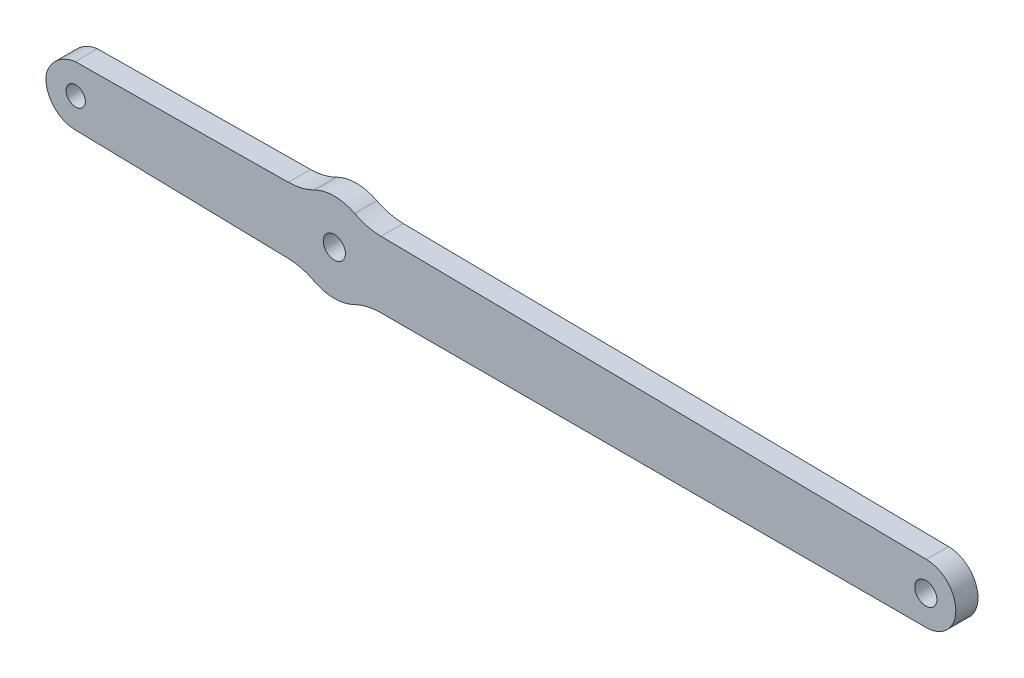
ISO-10303-21;
HEADER;
FILE_DESCRIPTION(('STEP AP214'),'2;1');
FILE_NAME('part.step','',(''),(''),'','','');
FILE_SCHEMA(('AUTOMOTIVE_DESIGN { 1 0 10303 214 1 1 1 1 }'));
ENDSEC;
DATA;
#1=APPLICATION_CONTEXT('core data for automotive mechanical design processes');
#2=APPLICATION_PROTOCOL_DEFINITION('international standard','automotive_design',2000,#1);
#3=PRODUCT_CONTEXT('',#1,'mechanical');
#4=PRODUCT('Part','Part','',(#3));
#5=PRODUCT_RELATED_PRODUCT_CATEGORY('part','',(#4));
#6=PRODUCT_DEFINITION_FORMATION('','',#4);
#7=PRODUCT_DEFINITION_CONTEXT('part definition',#1,'design');
#8=PRODUCT_DEFINITION('design','',#6,#7);
#9=PRODUCT_DEFINITION_SHAPE('','',#8);
#10=(LENGTH_UNIT() NAMED_UNIT(*) SI_UNIT(.MILLI.,.METRE.));
#11=(NAMED_UNIT(*) PLANE_ANGLE_UNIT() SI_UNIT($,.RADIAN.));
#12=(NAMED_UNIT(*) SI_UNIT($,.STERADIAN.) SOLID_ANGLE_UNIT());
#13=UNCERTAINTY_MEASURE_WITH_UNIT(LENGTH_MEASURE(1.E-05),#10,'distance_accuracy_value','');
#14=(GEOMETRIC_REPRESENTATION_CONTEXT(3) GLOBAL_UNCERTAINTY_ASSIGNED_CONTEXT((#13)) GLOBAL_UNIT_ASSIGNED_CONTEXT((#10,
#11,#12)) REPRESENTATION_CONTEXT('',''));
#15=CARTESIAN_POINT('',(0.,0.,0.));
#16=DIRECTION('',(0.,0.,1.));
#17=DIRECTION('',(1.,0.,0.));
#18=AXIS2_PLACEMENT_3D('',#15,#16,#17);
#19=CARTESIAN_POINT('',(34.7413667945725,33.4131534979443,3.));
#20=DIRECTION('',(0.,0.,1.));
#21=DIRECTION('',(1.,0.,0.));
#22=AXIS2_PLACEMENT_3D('',#19,#20,#21);
#23=PLANE('',#22);
#24=CARTESIAN_POINT('',(108.485791619428,45.4181778839305,3.));
#25=DIRECTION('',(0.,0.,1.));
#26=DIRECTION('',(1.,0.,0.));
#27=AXIS2_PLACEMENT_3D('',#24,#25,#26);
#28=CIRCLE('',#27,1.5);
#29=CARTESIAN_POINT('',(109.985791619428,45.4181778839305,3.));
#30=VERTEX_POINT('',#29);
#31=EDGE_CURVE('E300',#30,#30,#28,.T.);
#32=ORIENTED_EDGE('',*,*,#31,.F.);
#33=EDGE_LOOP('',(#32));
#34=FACE_BOUND('',#33,.T.);
#35=CARTESIAN_POINT('',(34.7413667945725,33.4131534979443,3.));
#36=DIRECTION('',(0.,0.,-1.));
#37=DIRECTION('',(1.,0.,0.));
#38=AXIS2_PLACEMENT_3D('',#35,#36,#37);
#39=CIRCLE('',#38,8.00062444748076);
#40=CARTESIAN_POINT('',(31.1676735141091,40.5712753107383,3.));
#41=VERTEX_POINT('',#40);
#42=CARTESIAN_POINT('',(34.7407076430112,41.4137779182721,3.));
#43=VERTEX_POINT('',#42);
#44=EDGE_CURVE('E186',#41,#43,#39,.T.);
#45=ORIENTED_EDGE('',*,*,#44,.T.);
#46=DIRECTION('',(0.9999999979286,6.43645913129201E-05,0.));
#47=VECTOR('',#46,1.);
#48=CARTESIAN_POINT('',(34.7407076430112,41.4137779182721,3.));
#49=LINE('',#48,#47);
#50=CARTESIAN_POINT('',(108.538521807091,41.4185278844251,3.));
#51=VERTEX_POINT('',#50);
#52=EDGE_CURVE('E109',#43,#51,#49,.T.);
#53=ORIENTED_EDGE('',*,*,#52,.T.);
#54=CARTESIAN_POINT('',(108.538360533566,45.41815610295,3.));
#55=DIRECTION('',(0.,0.,1.));
#56=DIRECTION('',(1.,0.,0.));
#57=AXIS2_PLACEMENT_3D('',#54,#55,#56);
#58=CIRCLE('',#57,3.99962822177635);
#59=CARTESIAN_POINT('',(108.53819926004,49.4177843214749,3.));
#60=VERTEX_POINT('',#59);
#61=EDGE_CURVE('E216',#51,#60,#58,.T.);
#62=ORIENTED_EDGE('',*,*,#61,.T.);
#63=DIRECTION('',(-0.999914327574007,0.0130895955713551,0.));
#64=VECTOR('',#63,1.);
#65=CARTESIAN_POINT('',(108.53819926004,49.4177843214749,3.));
#66=LINE('',#65,#64);
#67=CARTESIAN_POINT('',(34.7991172072817,50.3830817827238,3.));
#68=VERTEX_POINT('',#67);
#69=EDGE_CURVE('E235',#60,#68,#66,.T.);
#70=ORIENTED_EDGE('',*,*,#69,.T.);
#71=CARTESIAN_POINT('',(34.9040344841902,58.383038281616,3.));
#72=DIRECTION('',(0.,0.,-1.));
#73=DIRECTION('',(1.,0.,0.));
#74=AXIS2_PLACEMENT_3D('',#71,#72,#73);
#75=CIRCLE('',#74,8.00064445024035);
#76=CARTESIAN_POINT('',(31.2373486897375,51.272080054772,3.));
#77=VERTEX_POINT('',#76);
#78=EDGE_CURVE('E232',#68,#77,#75,.T.);
#79=ORIENTED_EDGE('',*,*,#78,.T.);
#80=CARTESIAN_POINT('',(28.4874515443855,45.9397415712136,3.));
#81=DIRECTION('',(0.,0.,1.));
#82=DIRECTION('',(1.,0.,0.));
#83=AXIS2_PLACEMENT_3D('',#80,#81,#82);
#84=CIRCLE('',#83,5.99964732407277);
#85=CARTESIAN_POINT('',(25.7884212340132,51.2980065326489,3.));
#86=VERTEX_POINT('',#85);
#87=EDGE_CURVE('E234',#77,#86,#84,.T.);
#88=ORIENTED_EDGE('',*,*,#87,.T.);
#89=CARTESIAN_POINT('',(22.1856435422027,58.4594985169969,3.));
#90=DIRECTION('',(0.,0.,-1.));
#91=DIRECTION('',(1.,0.,0.));
#92=AXIS2_PLACEMENT_3D('',#89,#90,#91);
#93=CIRCLE('',#92,8.01666854363385);
#94=CARTESIAN_POINT('',(22.2663308879415,50.4432360405852,3.));
#95=VERTEX_POINT('',#94);
#96=EDGE_CURVE('E237',#86,#95,#93,.T.);
#97=ORIENTED_EDGE('',*,*,#96,.T.);
#98=DIRECTION('',(-0.999954125619551,-0.00957844749632386,0.));
#99=VECTOR('',#98,1.);
#100=CARTESIAN_POINT('',(22.2663308879415,50.4432360405852,3.));
#101=LINE('',#100,#99);
#102=CARTESIAN_POINT('',(-6.55005098759136,50.1672071771033,3.));
#103=VERTEX_POINT('',#102);
#104=EDGE_CURVE('E243',#95,#103,#101,.T.);
#105=ORIENTED_EDGE('',*,*,#104,.T.);
#106=CARTESIAN_POINT('',(-5.91199405663408,45.4542740992874,3.));
#107=DIRECTION('',(0.,0.,1.));
#108=DIRECTION('',(1.,0.,0.));
#109=AXIS2_PLACEMENT_3D('',#106,#107,#108);
#110=CIRCLE('',#109,4.75592838919111);
#111=CARTESIAN_POINT('',(-10.4458957609955,46.8904461566337,3.));
#112=VERTEX_POINT('',#111);
#113=EDGE_CURVE('E245',#103,#112,#110,.T.);
#114=ORIENTED_EDGE('',*,*,#113,.T.);
#115=CARTESIAN_POINT('',(-6.51178674316586,46.1673865870044,3.));
#116=DIRECTION('',(0.,0.,1.));
#117=DIRECTION('',(1.,0.,0.));
#118=AXIS2_PLACEMENT_3D('',#115,#116,#117);
#119=CIRCLE('',#118,4.00000361317353);
#120=CARTESIAN_POINT('',(-6.60215655101686,42.1684039409767,3.));
#121=VERTEX_POINT('',#120);
#122=EDGE_CURVE('E143',#112,#121,#119,.T.);
#123=ORIENTED_EDGE('',*,*,#122,.T.);
#124=DIRECTION('',(0.999744437235561,-0.0226066409834058,0.));
#125=VECTOR('',#124,1.);
#126=CARTESIAN_POINT('',(-6.60215655101686,42.1684039409767,3.));
#127=LINE('',#126,#125);
#128=CARTESIAN_POINT('',(22.2081842020214,41.5169324191001,3.));
#129=VERTEX_POINT('',#128);
#130=EDGE_CURVE('E137',#121,#129,#127,.T.);
#131=ORIENTED_EDGE('',*,*,#130,.T.);
#132=CARTESIAN_POINT('',(22.1436226442124,33.9724726507622,3.));
#133=DIRECTION('',(0.,0.,-1.));
#134=DIRECTION('',(1.,0.,0.));
#135=AXIS2_PLACEMENT_3D('',#132,#133,#134);
#136=CIRCLE('',#135,7.54473600537592);
#137=CARTESIAN_POINT('',(25.7188960782272,40.6163014612332,3.));
#138=VERTEX_POINT('',#137);
#139=EDGE_CURVE('E141',#129,#138,#136,.T.);
#140=ORIENTED_EDGE('',*,*,#139,.T.);
#141=CARTESIAN_POINT('',(28.4874584149647,45.9393978754583,3.));
#142=DIRECTION('',(0.,0.,1.));
#143=DIRECTION('',(1.,0.,0.));
#144=AXIS2_PLACEMENT_3D('',#141,#142,#143);
#145=CIRCLE('',#144,6.00002440391182);
#146=EDGE_CURVE('E51',#138,#41,#145,.T.);
#147=ORIENTED_EDGE('',*,*,#146,.T.);
#148=EDGE_LOOP('',(#45,#53,#62,#70,#79,#88,#97,#105,#114,#123,#131,#140,#147));
#149=FACE_BOUND('',#148,.T.);
#150=CARTESIAN_POINT('',(28.4875107061247,45.9394174581099,3.));
#151=DIRECTION('',(0.,0.,1.));
#152=DIRECTION('',(1.,0.,0.));
#153=AXIS2_PLACEMENT_3D('',#150,#151,#152);
#154=CIRCLE('',#153,1.5);
#155=CARTESIAN_POINT('',(29.9875107061247,45.9394174581099,3.));
#156=VERTEX_POINT('',#155);
#157=EDGE_CURVE('E165',#156,#156,#154,.T.);
#158=ORIENTED_EDGE('',*,*,#157,.F.);
#159=EDGE_LOOP('',(#158));
#160=FACE_BOUND('',#159,.T.);
#161=CARTESIAN_POINT('',(-6.48552422865436,46.1742550414257,3.));
#162=DIRECTION('',(0.,0.,1.));
#163=DIRECTION('',(1.,0.,0.));
#164=AXIS2_PLACEMENT_3D('',#161,#162,#163);
#165=CIRCLE('',#164,1.3);
#166=CARTESIAN_POINT('',(-5.18552422865436,46.1742550414257,3.));
#167=VERTEX_POINT('',#166);
#168=EDGE_CURVE('E291',#167,#167,#165,.T.);
#169=ORIENTED_EDGE('',*,*,#168,.F.);
#170=EDGE_LOOP('',(#169));
#171=FACE_BOUND('',#170,.T.);
#172=ADVANCED_FACE('F34',(#34,#149,#160,#171),#23,.T.);
#173=CARTESIAN_POINT('',(34.7413667945725,33.4131534979443,0.));
#174=DIRECTION('',(0.,0.,1.));
#175=DIRECTION('',(1.,0.,0.));
#176=AXIS2_PLACEMENT_3D('',#173,#174,#175);
#177=PLANE('',#176);
#178=CARTESIAN_POINT('',(34.7413667945725,33.4131534979443,0.));
#179=DIRECTION('',(0.,0.,-1.));
#180=DIRECTION('',(1.,0.,0.));
#181=AXIS2_PLACEMENT_3D('',#178,#179,#180);
#182=CIRCLE('',#181,8.00062444748076);
#183=CARTESIAN_POINT('',(31.1676735141091,40.5712753107383,0.));
#184=VERTEX_POINT('',#183);
#185=CARTESIAN_POINT('',(34.7407076430112,41.4137779182721,0.));
#186=VERTEX_POINT('',#185);
#187=EDGE_CURVE('E161',#184,#186,#182,.T.);
#188=ORIENTED_EDGE('',*,*,#187,.F.);
#189=CARTESIAN_POINT('',(28.4874584149647,45.9393978754583,0.));
#190=DIRECTION('',(0.,0.,1.));
#191=DIRECTION('',(1.,0.,0.));
#192=AXIS2_PLACEMENT_3D('',#189,#190,#191);
#193=CIRCLE('',#192,6.00002440391182);
#194=CARTESIAN_POINT('',(25.7188960782272,40.6163014612332,0.));
#195=VERTEX_POINT('',#194);
#196=EDGE_CURVE('E101',#195,#184,#193,.T.);
#197=ORIENTED_EDGE('',*,*,#196,.F.);
#198=CARTESIAN_POINT('',(22.1436226442124,33.9724726507622,0.));
#199=DIRECTION('',(0.,0.,-1.));
#200=DIRECTION('',(1.,0.,0.));
#201=AXIS2_PLACEMENT_3D('',#198,#199,#200);
#202=CIRCLE('',#201,7.54473600537592);
#203=CARTESIAN_POINT('',(22.2081842020214,41.5169324191001,0.));
#204=VERTEX_POINT('',#203);
#205=EDGE_CURVE('E95',#204,#195,#202,.T.);
#206=ORIENTED_EDGE('',*,*,#205,.F.);
#207=DIRECTION('',(0.999744437235561,-0.0226066409834058,0.));
#208=VECTOR('',#207,1.);
#209=CARTESIAN_POINT('',(-6.60215655101686,42.1684039409767,0.));
#210=LINE('',#209,#208);
#211=CARTESIAN_POINT('',(-6.60215655101686,42.1684039409767,0.));
#212=VERTEX_POINT('',#211);
#213=EDGE_CURVE('E151',#212,#204,#210,.T.);
#214=ORIENTED_EDGE('',*,*,#213,.F.);
#215=CARTESIAN_POINT('',(-6.51178674316586,46.1673865870044,0.));
#216=DIRECTION('',(0.,0.,1.));
#217=DIRECTION('',(1.,0.,0.));
#218=AXIS2_PLACEMENT_3D('',#215,#216,#217);
#219=CIRCLE('',#218,4.00000361317353);
#220=CARTESIAN_POINT('',(-10.4458957609955,46.8904461566337,0.));
#221=VERTEX_POINT('',#220);
#222=EDGE_CURVE('E181',#221,#212,#219,.T.);
#223=ORIENTED_EDGE('',*,*,#222,.F.);
#224=CARTESIAN_POINT('',(-5.91199405663408,45.4542740992874,0.));
#225=DIRECTION('',(0.,0.,1.));
#226=DIRECTION('',(1.,0.,0.));
#227=AXIS2_PLACEMENT_3D('',#224,#225,#226);
#228=CIRCLE('',#227,4.75592838919111);
#229=CARTESIAN_POINT('',(-6.55005098759136,50.1672071771033,0.));
#230=VERTEX_POINT('',#229);
#231=EDGE_CURVE('E179',#230,#221,#228,.T.);
#232=ORIENTED_EDGE('',*,*,#231,.F.);
#233=DIRECTION('',(-0.999954125619551,-0.00957844749632386,0.));
#234=VECTOR('',#233,1.);
#235=CARTESIAN_POINT('',(22.2663308879415,50.4432360405852,0.));
#236=LINE('',#235,#234);
#237=CARTESIAN_POINT('',(22.2663308879415,50.4432360405852,0.));
#238=VERTEX_POINT('',#237);
#239=EDGE_CURVE('E177',#238,#230,#236,.T.);
#240=ORIENTED_EDGE('',*,*,#239,.F.);
#241=CARTESIAN_POINT('',(22.1856435422027,58.4594985169969,0.));
#242=DIRECTION('',(0.,0.,-1.));
#243=DIRECTION('',(1.,0.,0.));
#244=AXIS2_PLACEMENT_3D('',#241,#242,#243);
#245=CIRCLE('',#244,8.01666854363385);
#246=CARTESIAN_POINT('',(25.7884212340132,51.2980065326489,0.));
#247=VERTEX_POINT('',#246);
#248=EDGE_CURVE('E175',#247,#238,#245,.T.);
#249=ORIENTED_EDGE('',*,*,#248,.F.);
#250=CARTESIAN_POINT('',(28.4874515443855,45.9397415712136,0.));
#251=DIRECTION('',(0.,0.,1.));
#252=DIRECTION('',(1.,0.,0.));
#253=AXIS2_PLACEMENT_3D('',#250,#251,#252);
#254=CIRCLE('',#253,5.99964732407277);
#255=CARTESIAN_POINT('',(31.2373486897375,51.272080054772,0.));
#256=VERTEX_POINT('',#255);
#257=EDGE_CURVE('E173',#256,#247,#254,.T.);
#258=ORIENTED_EDGE('',*,*,#257,.F.);
#259=CARTESIAN_POINT('',(34.9040344841902,58.383038281616,0.));
#260=DIRECTION('',(0.,0.,-1.));
#261=DIRECTION('',(1.,0.,0.));
#262=AXIS2_PLACEMENT_3D('',#259,#260,#261);
#263=CIRCLE('',#262,8.00064445024035);
#264=CARTESIAN_POINT('',(34.7991172072817,50.3830817827238,0.));
#265=VERTEX_POINT('',#264);
#266=EDGE_CURVE('E171',#265,#256,#263,.T.);
#267=ORIENTED_EDGE('',*,*,#266,.F.);
#268=DIRECTION('',(-0.999914327574007,0.0130895955713551,0.));
#269=VECTOR('',#268,1.);
#270=CARTESIAN_POINT('',(108.53819926004,49.4177843214749,0.));
#271=LINE('',#270,#269);
#272=CARTESIAN_POINT('',(108.53819926004,49.4177843214749,0.));
#273=VERTEX_POINT('',#272);
#274=EDGE_CURVE('E169',#273,#265,#271,.T.);
#275=ORIENTED_EDGE('',*,*,#274,.F.);
#276=CARTESIAN_POINT('',(108.538360533566,45.41815610295,0.));
#277=DIRECTION('',(0.,0.,1.));
#278=DIRECTION('',(1.,0.,0.));
#279=AXIS2_PLACEMENT_3D('',#276,#277,#278);
#280=CIRCLE('',#279,3.99962822177635);
#281=CARTESIAN_POINT('',(108.538521807091,41.4185278844251,0.));
#282=VERTEX_POINT('',#281);
#283=EDGE_CURVE('E167',#282,#273,#280,.T.);
#284=ORIENTED_EDGE('',*,*,#283,.F.);
#285=DIRECTION('',(0.9999999979286,6.43645912927598E-05,0.));
#286=VECTOR('',#285,1.);
#287=CARTESIAN_POINT('',(104.038441639107,41.4182382386037,0.));
#288=LINE('',#287,#286);
#289=EDGE_CURVE('E164',#186,#282,#288,.T.);
#290=ORIENTED_EDGE('',*,*,#289,.F.);
#291=EDGE_LOOP('',(#188,#197,#206,#214,#223,#232,#240,#249,#258,#267,#275,#284,#290));
#292=FACE_BOUND('',#291,.T.);
#293=CARTESIAN_POINT('',(28.4875107061247,45.9394174581099,0.));
#294=DIRECTION('',(0.,0.,1.));
#295=DIRECTION('',(1.,0.,0.));
#296=AXIS2_PLACEMENT_3D('',#293,#294,#295);
#297=CIRCLE('',#296,1.5);
#298=CARTESIAN_POINT('',(29.9875107061247,45.9394174581099,0.));
#299=VERTEX_POINT('',#298);
#300=EDGE_CURVE('E303',#299,#299,#297,.T.);
#301=ORIENTED_EDGE('',*,*,#300,.T.);
#302=EDGE_LOOP('',(#301));
#303=FACE_BOUND('',#302,.T.);
#304=CARTESIAN_POINT('',(108.485791619428,45.4181778839305,0.));
#305=DIRECTION('',(0.,0.,1.));
#306=DIRECTION('',(1.,0.,0.));
#307=AXIS2_PLACEMENT_3D('',#304,#305,#306);
#308=CIRCLE('',#307,1.5);
#309=CARTESIAN_POINT('',(109.985791619428,45.4181778839305,0.));
#310=VERTEX_POINT('',#309);
#311=EDGE_CURVE('E297',#310,#310,#308,.T.);
#312=ORIENTED_EDGE('',*,*,#311,.T.);
#313=EDGE_LOOP('',(#312));
#314=FACE_BOUND('',#313,.T.);
#315=CARTESIAN_POINT('',(-6.48552422865436,46.1742550414257,0.));
#316=DIRECTION('',(0.,0.,1.));
#317=DIRECTION('',(1.,0.,0.));
#318=AXIS2_PLACEMENT_3D('',#315,#316,#317);
#319=CIRCLE('',#318,1.3);
#320=CARTESIAN_POINT('',(-5.18552422865436,46.1742550414257,0.));
#321=VERTEX_POINT('',#320);
#322=EDGE_CURVE('E294',#321,#321,#319,.T.);
#323=ORIENTED_EDGE('',*,*,#322,.T.);
#324=EDGE_LOOP('',(#323));
#325=FACE_BOUND('',#324,.T.);
#326=ADVANCED_FACE('F220',(#292,#303,#314,#325),#177,.F.);
#327=CARTESIAN_POINT('',(34.7413667945725,33.4131534979443,3.));
#328=DIRECTION('',(0.,0.,-1.));
#329=DIRECTION('',(-1.,0.,0.));
#330=AXIS2_PLACEMENT_3D('',#327,#328,#329);
#331=CYLINDRICAL_SURFACE('',#330,8.00062444748076);
#332=ORIENTED_EDGE('',*,*,#187,.T.);
#333=DIRECTION('',(0.,0.,-1.));
#334=VECTOR('',#333,1.);
#335=CARTESIAN_POINT('',(34.7407076430112,41.4137779182721,3.));
#336=LINE('',#335,#334);
#337=EDGE_CURVE('E11',#43,#186,#336,.T.);
#338=ORIENTED_EDGE('',*,*,#337,.F.);
#339=ORIENTED_EDGE('',*,*,#44,.F.);
#340=DIRECTION('',(0.,0.,-1.));
#341=VECTOR('',#340,1.);
#342=CARTESIAN_POINT('',(31.1676735141091,40.5712753107383,3.));
#343=LINE('',#342,#341);
#344=EDGE_CURVE('E157',#41,#184,#343,.T.);
#345=ORIENTED_EDGE('',*,*,#344,.T.);
#346=EDGE_LOOP('',(#332,#338,#339,#345));
#347=FACE_BOUND('',#346,.T.);
#348=ADVANCED_FACE('F36',(#347),#331,.F.);
#349=CARTESIAN_POINT('',(104.038441639107,41.4182382386037,3.));
#350=DIRECTION('',(-6.43645912927598E-05,0.9999999979286,0.));
#351=DIRECTION('',(-0.9999999979286,-6.43645912927599E-05,0.));
#352=AXIS2_PLACEMENT_3D('',#349,#350,#351);
#353=PLANE('',#352);
#354=ORIENTED_EDGE('',*,*,#289,.T.);
#355=DIRECTION('',(0.,0.,-1.));
#356=VECTOR('',#355,1.);
#357=CARTESIAN_POINT('',(108.538521807091,41.4185278844251,3.));
#358=LINE('',#357,#356);
#359=EDGE_CURVE('E43',#51,#282,#358,.T.);
#360=ORIENTED_EDGE('',*,*,#359,.F.);
#361=ORIENTED_EDGE('',*,*,#52,.F.);
#362=ORIENTED_EDGE('',*,*,#337,.T.);
#363=EDGE_LOOP('',(#354,#360,#361,#362));
#364=FACE_BOUND('',#363,.T.);
#365=ADVANCED_FACE('F415',(#364),#353,.F.);
#366=CARTESIAN_POINT('',(108.538360533566,45.41815610295,3.));
#367=DIRECTION('',(0.,0.,-1.));
#368=DIRECTION('',(-1.,0.,0.));
#369=AXIS2_PLACEMENT_3D('',#366,#367,#368);
#370=CYLINDRICAL_SURFACE('',#369,3.99962822177635);
#371=ORIENTED_EDGE('',*,*,#283,.T.);
#372=DIRECTION('',(0.,0.,-1.));
#373=VECTOR('',#372,1.);
#374=CARTESIAN_POINT('',(108.53819926004,49.4177843214749,3.));
#375=LINE('',#374,#373);
#376=EDGE_CURVE('E208',#60,#273,#375,.T.);
#377=ORIENTED_EDGE('',*,*,#376,.F.);
#378=ORIENTED_EDGE('',*,*,#61,.F.);
#379=ORIENTED_EDGE('',*,*,#359,.T.);
#380=EDGE_LOOP('',(#371,#377,#378,#379));
#381=FACE_BOUND('',#380,.T.);
#382=ADVANCED_FACE('F214',(#381),#370,.T.);
#383=CARTESIAN_POINT('',(108.53819926004,49.4177843214749,3.));
#384=DIRECTION('',(-0.0130895955713551,-0.999914327574007,0.));
#385=DIRECTION('',(0.999914327574007,-0.0130895955713551,0.));
#386=AXIS2_PLACEMENT_3D('',#383,#384,#385);
#387=PLANE('',#386);
#388=ORIENTED_EDGE('',*,*,#274,.T.);
#389=DIRECTION('',(0.,0.,-1.));
#390=VECTOR('',#389,1.);
#391=CARTESIAN_POINT('',(34.7991172072817,50.3830817827238,3.));
#392=LINE('',#391,#390);
#393=EDGE_CURVE('E205',#68,#265,#392,.T.);
#394=ORIENTED_EDGE('',*,*,#393,.F.);
#395=ORIENTED_EDGE('',*,*,#69,.F.);
#396=ORIENTED_EDGE('',*,*,#376,.T.);
#397=EDGE_LOOP('',(#388,#394,#395,#396));
#398=FACE_BOUND('',#397,.T.);
#399=ADVANCED_FACE('F226',(#398),#387,.F.);
#400=CARTESIAN_POINT('',(34.9040344841902,58.383038281616,3.));
#401=DIRECTION('',(0.,0.,-1.));
#402=DIRECTION('',(-1.,0.,0.));
#403=AXIS2_PLACEMENT_3D('',#400,#401,#402);
#404=CYLINDRICAL_SURFACE('',#403,8.00064445024035);
#405=ORIENTED_EDGE('',*,*,#266,.T.);
#406=DIRECTION('',(0.,0.,-1.));
#407=VECTOR('',#406,1.);
#408=CARTESIAN_POINT('',(31.2373486897375,51.272080054772,3.));
#409=LINE('',#408,#407);
#410=EDGE_CURVE('E202',#77,#256,#409,.T.);
#411=ORIENTED_EDGE('',*,*,#410,.F.);
#412=ORIENTED_EDGE('',*,*,#78,.F.);
#413=ORIENTED_EDGE('',*,*,#393,.T.);
#414=EDGE_LOOP('',(#405,#411,#412,#413));
#415=FACE_BOUND('',#414,.T.);
#416=ADVANCED_FACE('F230',(#415),#404,.F.);
#417=CARTESIAN_POINT('',(28.4874515443855,45.9397415712136,3.));
#418=DIRECTION('',(0.,0.,-1.));
#419=DIRECTION('',(-1.,0.,0.));
#420=AXIS2_PLACEMENT_3D('',#417,#418,#419);
#421=CYLINDRICAL_SURFACE('',#420,5.99964732407277);
#422=ORIENTED_EDGE('',*,*,#257,.T.);
#423=DIRECTION('',(0.,0.,-1.));
#424=VECTOR('',#423,1.);
#425=CARTESIAN_POINT('',(25.7884212340132,51.2980065326489,3.));
#426=LINE('',#425,#424);
#427=EDGE_CURVE('E199',#86,#247,#426,.T.);
#428=ORIENTED_EDGE('',*,*,#427,.F.);
#429=ORIENTED_EDGE('',*,*,#87,.F.);
#430=ORIENTED_EDGE('',*,*,#410,.T.);
#431=EDGE_LOOP('',(#422,#428,#429,#430));
#432=FACE_BOUND('',#431,.T.);
#433=ADVANCED_FACE('F380',(#432),#421,.T.);
#434=CARTESIAN_POINT('',(22.1856435422027,58.4594985169969,3.));
#435=DIRECTION('',(0.,0.,-1.));
#436=DIRECTION('',(-1.,0.,0.));
#437=AXIS2_PLACEMENT_3D('',#434,#435,#436);
#438=CYLINDRICAL_SURFACE('',#437,8.01666854363385);
#439=ORIENTED_EDGE('',*,*,#248,.T.);
#440=DIRECTION('',(0.,0.,-1.));
#441=VECTOR('',#440,1.);
#442=CARTESIAN_POINT('',(22.2663308879415,50.4432360405852,3.));
#443=LINE('',#442,#441);
#444=EDGE_CURVE('E196',#95,#238,#443,.T.);
#445=ORIENTED_EDGE('',*,*,#444,.F.);
#446=ORIENTED_EDGE('',*,*,#96,.F.);
#447=ORIENTED_EDGE('',*,*,#427,.T.);
#448=EDGE_LOOP('',(#439,#445,#446,#447));
#449=FACE_BOUND('',#448,.T.);
#450=ADVANCED_FACE('F370',(#449),#438,.F.);
#451=CARTESIAN_POINT('',(22.2663308879415,50.4432360405852,3.));
#452=DIRECTION('',(0.00957844749632385,-0.999954125619551,0.));
#453=DIRECTION('',(0.999954125619551,0.00957844749632386,0.));
#454=AXIS2_PLACEMENT_3D('',#451,#452,#453);
#455=PLANE('',#454);
#456=ORIENTED_EDGE('',*,*,#239,.T.);
#457=DIRECTION('',(0.,0.,-1.));
#458=VECTOR('',#457,1.);
#459=CARTESIAN_POINT('',(-6.55005098759136,50.1672071771033,3.));
#460=LINE('',#459,#458);
#461=EDGE_CURVE('E193',#103,#230,#460,.T.);
#462=ORIENTED_EDGE('',*,*,#461,.F.);
#463=ORIENTED_EDGE('',*,*,#104,.F.);
#464=ORIENTED_EDGE('',*,*,#444,.T.);
#465=EDGE_LOOP('',(#456,#462,#463,#464));
#466=FACE_BOUND('',#465,.T.);
#467=ADVANCED_FACE('F361',(#466),#455,.F.);
#468=CARTESIAN_POINT('',(-5.91199405663408,45.4542740992874,3.));
#469=DIRECTION('',(0.,0.,-1.));
#470=DIRECTION('',(-1.,0.,0.));
#471=AXIS2_PLACEMENT_3D('',#468,#469,#470);
#472=CYLINDRICAL_SURFACE('',#471,4.75592838919111);
#473=ORIENTED_EDGE('',*,*,#231,.T.);
#474=DIRECTION('',(0.,0.,-1.));
#475=VECTOR('',#474,1.);
#476=CARTESIAN_POINT('',(-10.4458957609955,46.8904461566337,3.));
#477=LINE('',#476,#475);
#478=EDGE_CURVE('E190',#112,#221,#477,.T.);
#479=ORIENTED_EDGE('',*,*,#478,.F.);
#480=ORIENTED_EDGE('',*,*,#113,.F.);
#481=ORIENTED_EDGE('',*,*,#461,.T.);
#482=EDGE_LOOP('',(#473,#479,#480,#481));
#483=FACE_BOUND('',#482,.T.);
#484=ADVANCED_FACE('F251',(#483),#472,.T.);
#485=CARTESIAN_POINT('',(-6.51178674316586,46.1673865870044,3.));
#486=DIRECTION('',(0.,0.,-1.));
#487=DIRECTION('',(-1.,0.,0.));
#488=AXIS2_PLACEMENT_3D('',#485,#486,#487);
#489=CYLINDRICAL_SURFACE('',#488,4.00000361317353);
#490=ORIENTED_EDGE('',*,*,#222,.T.);
#491=DIRECTION('',(0.,0.,-1.));
#492=VECTOR('',#491,1.);
#493=CARTESIAN_POINT('',(-6.60215655101686,42.1684039409767,3.));
#494=LINE('',#493,#492);
#495=EDGE_CURVE('E152',#121,#212,#494,.T.);
#496=ORIENTED_EDGE('',*,*,#495,.F.);
#497=ORIENTED_EDGE('',*,*,#122,.F.);
#498=ORIENTED_EDGE('',*,*,#478,.T.);
#499=EDGE_LOOP('',(#490,#496,#497,#498));
#500=FACE_BOUND('',#499,.T.);
#501=ADVANCED_FACE('F255',(#500),#489,.T.);
#502=CARTESIAN_POINT('',(-6.60215655101686,42.1684039409767,3.));
#503=DIRECTION('',(0.0226066409834057,0.99974443723556,0.));
#504=DIRECTION('',(-0.999744437235561,0.0226066409834058,0.));
#505=AXIS2_PLACEMENT_3D('',#502,#503,#504);
#506=PLANE('',#505);
#507=ORIENTED_EDGE('',*,*,#213,.T.);
#508=DIRECTION('',(0.,0.,-1.));
#509=VECTOR('',#508,1.);
#510=CARTESIAN_POINT('',(22.2081842020214,41.5169324191001,3.));
#511=LINE('',#510,#509);
#512=EDGE_CURVE('E148',#129,#204,#511,.T.);
#513=ORIENTED_EDGE('',*,*,#512,.F.);
#514=ORIENTED_EDGE('',*,*,#130,.F.);
#515=ORIENTED_EDGE('',*,*,#495,.T.);
#516=EDGE_LOOP('',(#507,#513,#514,#515));
#517=FACE_BOUND('',#516,.T.);
#518=ADVANCED_FACE('F149',(#517),#506,.F.);
#519=CARTESIAN_POINT('',(22.1436226442124,33.9724726507622,3.));
#520=DIRECTION('',(0.,0.,-1.));
#521=DIRECTION('',(-1.,0.,0.));
#522=AXIS2_PLACEMENT_3D('',#519,#520,#521);
#523=CYLINDRICAL_SURFACE('',#522,7.54473600537592);
#524=ORIENTED_EDGE('',*,*,#205,.T.);
#525=DIRECTION('',(0.,0.,-1.));
#526=VECTOR('',#525,1.);
#527=CARTESIAN_POINT('',(25.7188960782272,40.6163014612332,3.));
#528=LINE('',#527,#526);
#529=EDGE_CURVE('E153',#138,#195,#528,.T.);
#530=ORIENTED_EDGE('',*,*,#529,.F.);
#531=ORIENTED_EDGE('',*,*,#139,.F.);
#532=ORIENTED_EDGE('',*,*,#512,.T.);
#533=EDGE_LOOP('',(#524,#530,#531,#532));
#534=FACE_BOUND('',#533,.T.);
#535=ADVANCED_FACE('F155',(#534),#523,.F.);
#536=CARTESIAN_POINT('',(28.4874584149647,45.9393978754583,3.));
#537=DIRECTION('',(0.,0.,-1.));
#538=DIRECTION('',(-1.,0.,0.));
#539=AXIS2_PLACEMENT_3D('',#536,#537,#538);
#540=CYLINDRICAL_SURFACE('',#539,6.00002440391182);
#541=ORIENTED_EDGE('',*,*,#196,.T.);
#542=ORIENTED_EDGE('',*,*,#344,.F.);
#543=ORIENTED_EDGE('',*,*,#146,.F.);
#544=ORIENTED_EDGE('',*,*,#529,.T.);
#545=EDGE_LOOP('',(#541,#542,#543,#544));
#546=FACE_BOUND('',#545,.T.);
#547=ADVANCED_FACE('F259',(#546),#540,.T.);
#548=CARTESIAN_POINT('',(28.4875107061247,45.9394174581099,3.));
#549=DIRECTION('',(0.,0.,-1.));
#550=DIRECTION('',(-1.,0.,0.));
#551=AXIS2_PLACEMENT_3D('',#548,#549,#550);
#552=CYLINDRICAL_SURFACE('',#551,1.5);
#553=ORIENTED_EDGE('',*,*,#157,.T.);
#554=EDGE_LOOP('',(#553));
#555=FACE_BOUND('',#554,.T.);
#556=ORIENTED_EDGE('',*,*,#300,.F.);
#557=EDGE_LOOP('',(#556));
#558=FACE_BOUND('',#557,.T.);
#559=ADVANCED_FACE('F261',(#555,#558),#552,.F.);
#560=CARTESIAN_POINT('',(108.485791619428,45.4181778839305,3.));
#561=DIRECTION('',(0.,0.,-1.));
#562=DIRECTION('',(-1.,0.,0.));
#563=AXIS2_PLACEMENT_3D('',#560,#561,#562);
#564=CYLINDRICAL_SURFACE('',#563,1.5);
#565=ORIENTED_EDGE('',*,*,#31,.T.);
#566=EDGE_LOOP('',(#565));
#567=FACE_BOUND('',#566,.T.);
#568=ORIENTED_EDGE('',*,*,#311,.F.);
#569=EDGE_LOOP('',(#568));
#570=FACE_BOUND('',#569,.T.);
#571=ADVANCED_FACE('F267',(#567,#570),#564,.F.);
#572=CARTESIAN_POINT('',(-6.48552422865436,46.1742550414257,3.));
#573=DIRECTION('',(0.,0.,-1.));
#574=DIRECTION('',(-1.,0.,0.));
#575=AXIS2_PLACEMENT_3D('',#572,#573,#574);
#576=CYLINDRICAL_SURFACE('',#575,1.3);
#577=ORIENTED_EDGE('',*,*,#168,.T.);
#578=EDGE_LOOP('',(#577));
#579=FACE_BOUND('',#578,.T.);
#580=ORIENTED_EDGE('',*,*,#322,.F.);
#581=EDGE_LOOP('',(#580));
#582=FACE_BOUND('',#581,.T.);
#583=ADVANCED_FACE('F282',(#579,#582),#576,.F.);
#584=CLOSED_SHELL('',(#172,#326,#348,#365,#382,#399,#416,#433,#450,#467,#484,#501,#518,#535,
#547,#559,#571,#583));
#585=MANIFOLD_SOLID_BREP('B2',#584);
#586=ADVANCED_BREP_SHAPE_REPRESENTATION('',(#18,#585),#14);
#587=SHAPE_DEFINITION_REPRESENTATION(#9,#586);
ENDSEC;
END-ISO-10303-21;
